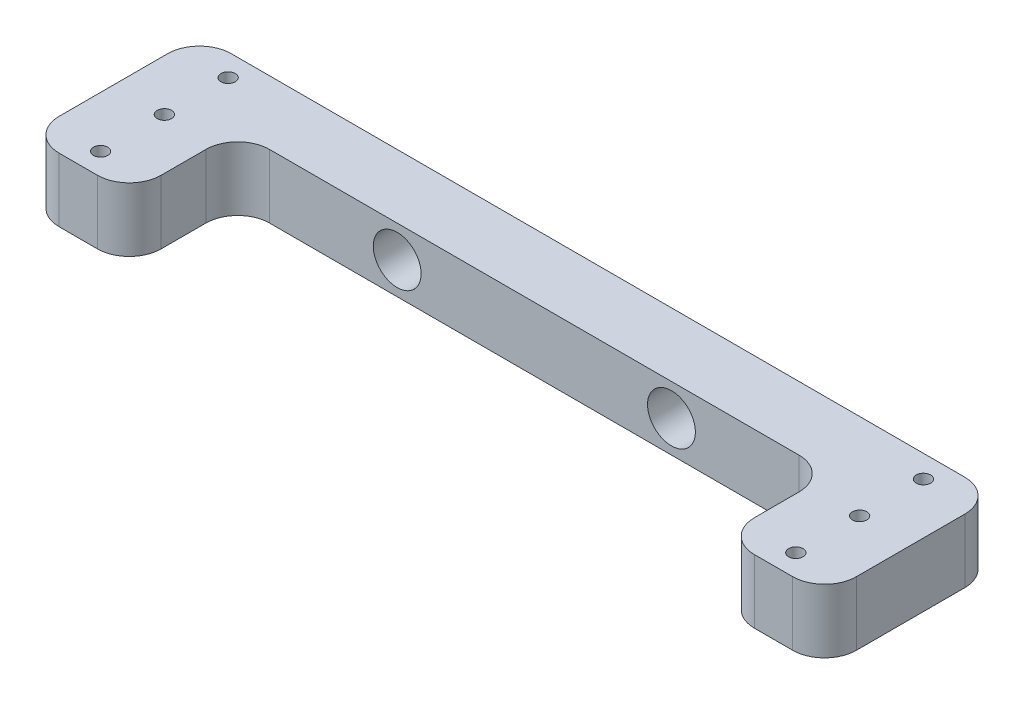
ISO-10303-21;
HEADER;
FILE_DESCRIPTION(('STEP AP214'),'2;1');
FILE_NAME('part.step','',(''),(''),'','','');
FILE_SCHEMA(('AUTOMOTIVE_DESIGN { 1 0 10303 214 1 1 1 1 }'));
ENDSEC;
DATA;
#1=APPLICATION_CONTEXT('core data for automotive mechanical design processes');
#2=APPLICATION_PROTOCOL_DEFINITION('international standard','automotive_design',2000,#1);
#3=PRODUCT_CONTEXT('',#1,'mechanical');
#4=PRODUCT('Part','Part','',(#3));
#5=PRODUCT_RELATED_PRODUCT_CATEGORY('part','',(#4));
#6=PRODUCT_DEFINITION_FORMATION('','',#4);
#7=PRODUCT_DEFINITION_CONTEXT('part definition',#1,'design');
#8=PRODUCT_DEFINITION('design','',#6,#7);
#9=PRODUCT_DEFINITION_SHAPE('','',#8);
#10=(LENGTH_UNIT() NAMED_UNIT(*) SI_UNIT(.MILLI.,.METRE.));
#11=(NAMED_UNIT(*) PLANE_ANGLE_UNIT() SI_UNIT($,.RADIAN.));
#12=(NAMED_UNIT(*) SI_UNIT($,.STERADIAN.) SOLID_ANGLE_UNIT());
#13=UNCERTAINTY_MEASURE_WITH_UNIT(LENGTH_MEASURE(1.E-05),#10,'distance_accuracy_value','');
#14=(GEOMETRIC_REPRESENTATION_CONTEXT(3) GLOBAL_UNCERTAINTY_ASSIGNED_CONTEXT((#13)) GLOBAL_UNIT_ASSIGNED_CONTEXT((#10,
#11,#12)) REPRESENTATION_CONTEXT('',''));
#15=CARTESIAN_POINT('',(0.,0.,0.));
#16=DIRECTION('',(0.,0.,1.));
#17=DIRECTION('',(1.,0.,0.));
#18=AXIS2_PLACEMENT_3D('',#15,#16,#17);
#19=CARTESIAN_POINT('',(-103.,20.,24.));
#20=DIRECTION('',(0.,1.,0.));
#21=DIRECTION('',(0.,0.,1.));
#22=AXIS2_PLACEMENT_3D('',#19,#20,#21);
#23=PLANE('',#22);
#24=CARTESIAN_POINT('',(109.,20.,6.99999999999993));
#25=DIRECTION('',(0.,1.,0.));
#26=DIRECTION('',(0.,0.,-1.));
#27=AXIS2_PLACEMENT_3D('',#24,#25,#26);
#28=CIRCLE('',#27,2.25);
#29=CARTESIAN_POINT('',(109.,20.,4.74999999999993));
#30=VERTEX_POINT('',#29);
#31=EDGE_CURVE('E413',#30,#30,#28,.T.);
#32=ORIENTED_EDGE('',*,*,#31,.F.);
#33=EDGE_LOOP('',(#32));
#34=FACE_BOUND('',#33,.T.);
#35=CARTESIAN_POINT('',(-109.,20.,27.));
#36=DIRECTION('',(0.,1.,0.));
#37=DIRECTION('',(0.,0.,1.));
#38=AXIS2_PLACEMENT_3D('',#35,#36,#37);
#39=CIRCLE('',#38,2.25);
#40=CARTESIAN_POINT('',(-109.,20.,29.25));
#41=VERTEX_POINT('',#40);
#42=EDGE_CURVE('E425',#41,#41,#39,.T.);
#43=ORIENTED_EDGE('',*,*,#42,.F.);
#44=EDGE_LOOP('',(#43));
#45=FACE_BOUND('',#44,.T.);
#46=CARTESIAN_POINT('',(-109.,20.,-13.));
#47=DIRECTION('',(0.,1.,0.));
#48=DIRECTION('',(0.,0.,1.));
#49=AXIS2_PLACEMENT_3D('',#46,#47,#48);
#50=CIRCLE('',#49,2.25);
#51=CARTESIAN_POINT('',(-109.,20.,-10.75));
#52=VERTEX_POINT('',#51);
#53=EDGE_CURVE('E196',#52,#52,#50,.T.);
#54=ORIENTED_EDGE('',*,*,#53,.F.);
#55=EDGE_LOOP('',(#54));
#56=FACE_BOUND('',#55,.T.);
#57=CARTESIAN_POINT('',(-103.,20.,24.));
#58=DIRECTION('',(0.,1.,0.));
#59=DIRECTION('',(0.,0.,1.));
#60=AXIS2_PLACEMENT_3D('',#57,#58,#59);
#61=CIRCLE('',#60,10.);
#62=CARTESIAN_POINT('',(-103.,20.,34.));
#63=VERTEX_POINT('',#62);
#64=CARTESIAN_POINT('',(-93.,20.,24.));
#65=VERTEX_POINT('',#64);
#66=EDGE_CURVE('E224',#63,#65,#61,.T.);
#67=ORIENTED_EDGE('',*,*,#66,.T.);
#68=DIRECTION('',(0.,0.,-1.));
#69=VECTOR('',#68,1.);
#70=CARTESIAN_POINT('',(-93.,20.,24.));
#71=LINE('',#70,#69);
#72=CARTESIAN_POINT('',(-93.,20.,10.));
#73=VERTEX_POINT('',#72);
#74=EDGE_CURVE('E131',#65,#73,#71,.T.);
#75=ORIENTED_EDGE('',*,*,#74,.T.);
#76=CARTESIAN_POINT('',(-83.,20.,10.));
#77=DIRECTION('',(0.,-1.,0.));
#78=DIRECTION('',(0.,0.,-1.));
#79=AXIS2_PLACEMENT_3D('',#76,#77,#78);
#80=CIRCLE('',#79,10.);
#81=CARTESIAN_POINT('',(-83.,20.,0.));
#82=VERTEX_POINT('',#81);
#83=EDGE_CURVE('E263',#73,#82,#80,.T.);
#84=ORIENTED_EDGE('',*,*,#83,.T.);
#85=DIRECTION('',(1.,0.,0.));
#86=VECTOR('',#85,1.);
#87=CARTESIAN_POINT('',(-83.,20.,0.));
#88=LINE('',#87,#86);
#89=CARTESIAN_POINT('',(83.,20.,0.));
#90=VERTEX_POINT('',#89);
#91=EDGE_CURVE('E281',#82,#90,#88,.T.);
#92=ORIENTED_EDGE('',*,*,#91,.T.);
#93=CARTESIAN_POINT('',(83.,20.,9.99999999999998));
#94=DIRECTION('',(0.,-1.,0.));
#95=DIRECTION('',(0.,0.,1.));
#96=AXIS2_PLACEMENT_3D('',#93,#94,#95);
#97=CIRCLE('',#96,10.);
#98=CARTESIAN_POINT('',(93.,20.,9.99999999999998));
#99=VERTEX_POINT('',#98);
#100=EDGE_CURVE('E278',#90,#99,#97,.T.);
#101=ORIENTED_EDGE('',*,*,#100,.T.);
#102=DIRECTION('',(0.,0.,1.));
#103=VECTOR('',#102,1.);
#104=CARTESIAN_POINT('',(93.,20.,23.9999999999999));
#105=LINE('',#104,#103);
#106=CARTESIAN_POINT('',(93.,20.,23.9999999999999));
#107=VERTEX_POINT('',#106);
#108=EDGE_CURVE('E280',#99,#107,#105,.T.);
#109=ORIENTED_EDGE('',*,*,#108,.T.);
#110=CARTESIAN_POINT('',(103.,20.,24.));
#111=DIRECTION('',(0.,1.,0.));
#112=DIRECTION('',(0.,0.,-1.));
#113=AXIS2_PLACEMENT_3D('',#110,#111,#112);
#114=CIRCLE('',#113,10.);
#115=CARTESIAN_POINT('',(103.,20.,34.));
#116=VERTEX_POINT('',#115);
#117=EDGE_CURVE('E283',#107,#116,#114,.T.);
#118=ORIENTED_EDGE('',*,*,#117,.T.);
#119=DIRECTION('',(1.,0.,0.));
#120=VECTOR('',#119,1.);
#121=CARTESIAN_POINT('',(115.,20.,34.));
#122=LINE('',#121,#120);
#123=CARTESIAN_POINT('',(115.,20.,34.));
#124=VERTEX_POINT('',#123);
#125=EDGE_CURVE('E289',#116,#124,#122,.T.);
#126=ORIENTED_EDGE('',*,*,#125,.T.);
#127=CARTESIAN_POINT('',(115.,20.,24.));
#128=DIRECTION('',(0.,1.,0.));
#129=DIRECTION('',(0.,0.,-1.));
#130=AXIS2_PLACEMENT_3D('',#127,#128,#129);
#131=CIRCLE('',#130,10.);
#132=CARTESIAN_POINT('',(125.,20.,23.9999999999999));
#133=VERTEX_POINT('',#132);
#134=EDGE_CURVE('E291',#124,#133,#131,.T.);
#135=ORIENTED_EDGE('',*,*,#134,.T.);
#136=DIRECTION('',(0.,0.,-1.));
#137=VECTOR('',#136,1.);
#138=CARTESIAN_POINT('',(125.,20.,-9.99999999999994));
#139=LINE('',#138,#137);
#140=CARTESIAN_POINT('',(125.,20.,-9.99999999999994));
#141=VERTEX_POINT('',#140);
#142=EDGE_CURVE('E293',#133,#141,#139,.T.);
#143=ORIENTED_EDGE('',*,*,#142,.T.);
#144=CARTESIAN_POINT('',(115.,20.,-10.));
#145=DIRECTION('',(0.,1.,0.));
#146=DIRECTION('',(0.,0.,-1.));
#147=AXIS2_PLACEMENT_3D('',#144,#145,#146);
#148=CIRCLE('',#147,10.);
#149=CARTESIAN_POINT('',(115.,20.,-20.));
#150=VERTEX_POINT('',#149);
#151=EDGE_CURVE('E295',#141,#150,#148,.T.);
#152=ORIENTED_EDGE('',*,*,#151,.T.);
#153=DIRECTION('',(-1.,0.,0.));
#154=VECTOR('',#153,1.);
#155=CARTESIAN_POINT('',(115.,20.,-20.));
#156=LINE('',#155,#154);
#157=CARTESIAN_POINT('',(-115.,20.,-20.));
#158=VERTEX_POINT('',#157);
#159=EDGE_CURVE('E297',#150,#158,#156,.T.);
#160=ORIENTED_EDGE('',*,*,#159,.T.);
#161=CARTESIAN_POINT('',(-115.,20.,-9.99999999999999));
#162=DIRECTION('',(0.,1.,0.));
#163=DIRECTION('',(0.,0.,1.));
#164=AXIS2_PLACEMENT_3D('',#161,#162,#163);
#165=CIRCLE('',#164,10.);
#166=CARTESIAN_POINT('',(-125.,20.,-9.99999999999991));
#167=VERTEX_POINT('',#166);
#168=EDGE_CURVE('E174',#158,#167,#165,.T.);
#169=ORIENTED_EDGE('',*,*,#168,.T.);
#170=DIRECTION('',(0.,0.,1.));
#171=VECTOR('',#170,1.);
#172=CARTESIAN_POINT('',(-125.,20.,-9.99999999999991));
#173=LINE('',#172,#171);
#174=CARTESIAN_POINT('',(-125.,20.,23.9999999999999));
#175=VERTEX_POINT('',#174);
#176=EDGE_CURVE('E168',#167,#175,#173,.T.);
#177=ORIENTED_EDGE('',*,*,#176,.T.);
#178=CARTESIAN_POINT('',(-115.,20.,24.));
#179=DIRECTION('',(0.,1.,0.));
#180=DIRECTION('',(0.,0.,1.));
#181=AXIS2_PLACEMENT_3D('',#178,#179,#180);
#182=CIRCLE('',#181,10.);
#183=CARTESIAN_POINT('',(-115.,20.,34.));
#184=VERTEX_POINT('',#183);
#185=EDGE_CURVE('E172',#175,#184,#182,.T.);
#186=ORIENTED_EDGE('',*,*,#185,.T.);
#187=DIRECTION('',(1.,0.,0.));
#188=VECTOR('',#187,1.);
#189=CARTESIAN_POINT('',(-115.,20.,34.));
#190=LINE('',#189,#188);
#191=EDGE_CURVE('E64',#184,#63,#190,.T.);
#192=ORIENTED_EDGE('',*,*,#191,.T.);
#193=EDGE_LOOP('',(#67,#75,#84,#92,#101,#109,#118,#126,#135,#143,#152,#160,#169,#177,#186,#192));
#194=FACE_BOUND('',#193,.T.);
#195=CARTESIAN_POINT('',(-109.,20.,6.99999999999998));
#196=DIRECTION('',(0.,1.,0.));
#197=DIRECTION('',(0.,0.,1.));
#198=AXIS2_PLACEMENT_3D('',#195,#196,#197);
#199=CIRCLE('',#198,2.25);
#200=CARTESIAN_POINT('',(-109.,20.,9.24999999999998));
#201=VERTEX_POINT('',#200);
#202=EDGE_CURVE('E431',#201,#201,#199,.T.);
#203=ORIENTED_EDGE('',*,*,#202,.F.);
#204=EDGE_LOOP('',(#203));
#205=FACE_BOUND('',#204,.T.);
#206=CARTESIAN_POINT('',(109.,20.,26.9999999999999));
#207=DIRECTION('',(0.,1.,0.));
#208=DIRECTION('',(0.,0.,-1.));
#209=AXIS2_PLACEMENT_3D('',#206,#207,#208);
#210=CIRCLE('',#209,2.25);
#211=CARTESIAN_POINT('',(109.,20.,24.7499999999999));
#212=VERTEX_POINT('',#211);
#213=EDGE_CURVE('E419',#212,#212,#210,.T.);
#214=ORIENTED_EDGE('',*,*,#213,.F.);
#215=EDGE_LOOP('',(#214));
#216=FACE_BOUND('',#215,.T.);
#217=CARTESIAN_POINT('',(109.,20.,-13.));
#218=DIRECTION('',(0.,1.,0.));
#219=DIRECTION('',(0.,0.,-1.));
#220=AXIS2_PLACEMENT_3D('',#217,#218,#219);
#221=CIRCLE('',#220,2.25);
#222=CARTESIAN_POINT('',(109.,20.,-15.25));
#223=VERTEX_POINT('',#222);
#224=EDGE_CURVE('E407',#223,#223,#221,.T.);
#225=ORIENTED_EDGE('',*,*,#224,.F.);
#226=EDGE_LOOP('',(#225));
#227=FACE_BOUND('',#226,.T.);
#228=ADVANCED_FACE('F47',(#34,#45,#56,#194,#205,#216,#227),#23,.T.);
#229=CARTESIAN_POINT('',(-103.,0.,24.));
#230=DIRECTION('',(0.,1.,0.));
#231=DIRECTION('',(0.,0.,1.));
#232=AXIS2_PLACEMENT_3D('',#229,#230,#231);
#233=PLANE('',#232);
#234=CARTESIAN_POINT('',(-103.,0.,24.));
#235=DIRECTION('',(0.,1.,0.));
#236=DIRECTION('',(0.,0.,1.));
#237=AXIS2_PLACEMENT_3D('',#234,#235,#236);
#238=CIRCLE('',#237,10.);
#239=CARTESIAN_POINT('',(-103.,0.,34.));
#240=VERTEX_POINT('',#239);
#241=CARTESIAN_POINT('',(-93.,0.,24.));
#242=VERTEX_POINT('',#241);
#243=EDGE_CURVE('E192',#240,#242,#238,.T.);
#244=ORIENTED_EDGE('',*,*,#243,.F.);
#245=DIRECTION('',(1.,0.,0.));
#246=VECTOR('',#245,1.);
#247=CARTESIAN_POINT('',(-115.,0.,34.));
#248=LINE('',#247,#246);
#249=CARTESIAN_POINT('',(-115.,0.,34.));
#250=VERTEX_POINT('',#249);
#251=EDGE_CURVE('E123',#250,#240,#248,.T.);
#252=ORIENTED_EDGE('',*,*,#251,.F.);
#253=CARTESIAN_POINT('',(-115.,0.,24.));
#254=DIRECTION('',(0.,1.,0.));
#255=DIRECTION('',(0.,0.,1.));
#256=AXIS2_PLACEMENT_3D('',#253,#254,#255);
#257=CIRCLE('',#256,10.);
#258=CARTESIAN_POINT('',(-125.,0.,23.9999999999999));
#259=VERTEX_POINT('',#258);
#260=EDGE_CURVE('E117',#259,#250,#257,.T.);
#261=ORIENTED_EDGE('',*,*,#260,.F.);
#262=DIRECTION('',(0.,0.,1.));
#263=VECTOR('',#262,1.);
#264=CARTESIAN_POINT('',(-125.,0.,-9.99999999999991));
#265=LINE('',#264,#263);
#266=CARTESIAN_POINT('',(-125.,0.,-9.99999999999991));
#267=VERTEX_POINT('',#266);
#268=EDGE_CURVE('E182',#267,#259,#265,.T.);
#269=ORIENTED_EDGE('',*,*,#268,.F.);
#270=CARTESIAN_POINT('',(-115.,0.,-9.99999999999999));
#271=DIRECTION('',(0.,1.,0.));
#272=DIRECTION('',(0.,0.,1.));
#273=AXIS2_PLACEMENT_3D('',#270,#271,#272);
#274=CIRCLE('',#273,10.);
#275=CARTESIAN_POINT('',(-115.,0.,-20.));
#276=VERTEX_POINT('',#275);
#277=EDGE_CURVE('E219',#276,#267,#274,.T.);
#278=ORIENTED_EDGE('',*,*,#277,.F.);
#279=DIRECTION('',(-1.,0.,0.));
#280=VECTOR('',#279,1.);
#281=CARTESIAN_POINT('',(115.,0.,-20.));
#282=LINE('',#281,#280);
#283=CARTESIAN_POINT('',(115.,0.,-20.));
#284=VERTEX_POINT('',#283);
#285=EDGE_CURVE('E217',#284,#276,#282,.T.);
#286=ORIENTED_EDGE('',*,*,#285,.F.);
#287=CARTESIAN_POINT('',(115.,0.,-10.));
#288=DIRECTION('',(0.,1.,0.));
#289=DIRECTION('',(0.,0.,-1.));
#290=AXIS2_PLACEMENT_3D('',#287,#288,#289);
#291=CIRCLE('',#290,10.);
#292=CARTESIAN_POINT('',(125.,0.,-9.99999999999994));
#293=VERTEX_POINT('',#292);
#294=EDGE_CURVE('E215',#293,#284,#291,.T.);
#295=ORIENTED_EDGE('',*,*,#294,.F.);
#296=DIRECTION('',(0.,0.,-1.));
#297=VECTOR('',#296,1.);
#298=CARTESIAN_POINT('',(125.,0.,-9.99999999999994));
#299=LINE('',#298,#297);
#300=CARTESIAN_POINT('',(125.,0.,23.9999999999999));
#301=VERTEX_POINT('',#300);
#302=EDGE_CURVE('E213',#301,#293,#299,.T.);
#303=ORIENTED_EDGE('',*,*,#302,.F.);
#304=CARTESIAN_POINT('',(115.,0.,24.));
#305=DIRECTION('',(0.,1.,0.));
#306=DIRECTION('',(0.,0.,-1.));
#307=AXIS2_PLACEMENT_3D('',#304,#305,#306);
#308=CIRCLE('',#307,10.);
#309=CARTESIAN_POINT('',(115.,0.,34.));
#310=VERTEX_POINT('',#309);
#311=EDGE_CURVE('E211',#310,#301,#308,.T.);
#312=ORIENTED_EDGE('',*,*,#311,.F.);
#313=DIRECTION('',(1.,0.,0.));
#314=VECTOR('',#313,1.);
#315=CARTESIAN_POINT('',(115.,0.,34.));
#316=LINE('',#315,#314);
#317=CARTESIAN_POINT('',(103.,0.,34.));
#318=VERTEX_POINT('',#317);
#319=EDGE_CURVE('E209',#318,#310,#316,.T.);
#320=ORIENTED_EDGE('',*,*,#319,.F.);
#321=CARTESIAN_POINT('',(103.,0.,24.));
#322=DIRECTION('',(0.,1.,0.));
#323=DIRECTION('',(0.,0.,-1.));
#324=AXIS2_PLACEMENT_3D('',#321,#322,#323);
#325=CIRCLE('',#324,10.);
#326=CARTESIAN_POINT('',(93.,0.,23.9999999999999));
#327=VERTEX_POINT('',#326);
#328=EDGE_CURVE('E207',#327,#318,#325,.T.);
#329=ORIENTED_EDGE('',*,*,#328,.F.);
#330=DIRECTION('',(0.,0.,1.));
#331=VECTOR('',#330,1.);
#332=CARTESIAN_POINT('',(93.,0.,23.9999999999999));
#333=LINE('',#332,#331);
#334=CARTESIAN_POINT('',(93.,0.,9.99999999999998));
#335=VERTEX_POINT('',#334);
#336=EDGE_CURVE('E205',#335,#327,#333,.T.);
#337=ORIENTED_EDGE('',*,*,#336,.F.);
#338=CARTESIAN_POINT('',(83.,0.,9.99999999999998));
#339=DIRECTION('',(0.,-1.,0.));
#340=DIRECTION('',(0.,0.,1.));
#341=AXIS2_PLACEMENT_3D('',#338,#339,#340);
#342=CIRCLE('',#341,10.);
#343=CARTESIAN_POINT('',(83.,0.,0.));
#344=VERTEX_POINT('',#343);
#345=EDGE_CURVE('E203',#344,#335,#342,.T.);
#346=ORIENTED_EDGE('',*,*,#345,.F.);
#347=DIRECTION('',(1.,0.,0.));
#348=VECTOR('',#347,1.);
#349=CARTESIAN_POINT('',(83.,0.,0.));
#350=LINE('',#349,#348);
#351=CARTESIAN_POINT('',(-83.,0.,0.));
#352=VERTEX_POINT('',#351);
#353=EDGE_CURVE('E201',#352,#344,#350,.T.);
#354=ORIENTED_EDGE('',*,*,#353,.F.);
#355=CARTESIAN_POINT('',(-83.,0.,10.));
#356=DIRECTION('',(0.,-1.,0.));
#357=DIRECTION('',(0.,0.,-1.));
#358=AXIS2_PLACEMENT_3D('',#355,#356,#357);
#359=CIRCLE('',#358,10.);
#360=CARTESIAN_POINT('',(-93.,0.,10.));
#361=VERTEX_POINT('',#360);
#362=EDGE_CURVE('E198',#361,#352,#359,.T.);
#363=ORIENTED_EDGE('',*,*,#362,.F.);
#364=DIRECTION('',(0.,0.,-1.));
#365=VECTOR('',#364,1.);
#366=CARTESIAN_POINT('',(-93.,0.,24.));
#367=LINE('',#366,#365);
#368=EDGE_CURVE('E195',#242,#361,#367,.T.);
#369=ORIENTED_EDGE('',*,*,#368,.F.);
#370=EDGE_LOOP('',(#244,#252,#261,#269,#278,#286,#295,#303,#312,#320,#329,#337,#346,#354,#363,#369));
#371=FACE_BOUND('',#370,.T.);
#372=CARTESIAN_POINT('',(-109.,0.,-13.));
#373=DIRECTION('',(0.,1.,0.));
#374=DIRECTION('',(0.,0.,1.));
#375=AXIS2_PLACEMENT_3D('',#372,#373,#374);
#376=CIRCLE('',#375,2.25);
#377=CARTESIAN_POINT('',(-109.,0.,-10.75));
#378=VERTEX_POINT('',#377);
#379=EDGE_CURVE('E434',#378,#378,#376,.T.);
#380=ORIENTED_EDGE('',*,*,#379,.T.);
#381=EDGE_LOOP('',(#380));
#382=FACE_BOUND('',#381,.T.);
#383=CARTESIAN_POINT('',(-109.,0.,6.99999999999998));
#384=DIRECTION('',(0.,1.,0.));
#385=DIRECTION('',(0.,0.,1.));
#386=AXIS2_PLACEMENT_3D('',#383,#384,#385);
#387=CIRCLE('',#386,2.25);
#388=CARTESIAN_POINT('',(-109.,0.,9.24999999999998));
#389=VERTEX_POINT('',#388);
#390=EDGE_CURVE('E428',#389,#389,#387,.T.);
#391=ORIENTED_EDGE('',*,*,#390,.T.);
#392=EDGE_LOOP('',(#391));
#393=FACE_BOUND('',#392,.T.);
#394=CARTESIAN_POINT('',(-109.,0.,27.));
#395=DIRECTION('',(0.,1.,0.));
#396=DIRECTION('',(0.,0.,1.));
#397=AXIS2_PLACEMENT_3D('',#394,#395,#396);
#398=CIRCLE('',#397,2.25);
#399=CARTESIAN_POINT('',(-109.,0.,29.25));
#400=VERTEX_POINT('',#399);
#401=EDGE_CURVE('E422',#400,#400,#398,.T.);
#402=ORIENTED_EDGE('',*,*,#401,.T.);
#403=EDGE_LOOP('',(#402));
#404=FACE_BOUND('',#403,.T.);
#405=CARTESIAN_POINT('',(109.,0.,26.9999999999999));
#406=DIRECTION('',(0.,1.,0.));
#407=DIRECTION('',(0.,0.,-1.));
#408=AXIS2_PLACEMENT_3D('',#405,#406,#407);
#409=CIRCLE('',#408,2.25);
#410=CARTESIAN_POINT('',(109.,0.,24.7499999999999));
#411=VERTEX_POINT('',#410);
#412=EDGE_CURVE('E416',#411,#411,#409,.T.);
#413=ORIENTED_EDGE('',*,*,#412,.T.);
#414=EDGE_LOOP('',(#413));
#415=FACE_BOUND('',#414,.T.);
#416=CARTESIAN_POINT('',(109.,0.,6.99999999999993));
#417=DIRECTION('',(0.,1.,0.));
#418=DIRECTION('',(0.,0.,-1.));
#419=AXIS2_PLACEMENT_3D('',#416,#417,#418);
#420=CIRCLE('',#419,2.25);
#421=CARTESIAN_POINT('',(109.,0.,4.74999999999993));
#422=VERTEX_POINT('',#421);
#423=EDGE_CURVE('E410',#422,#422,#420,.T.);
#424=ORIENTED_EDGE('',*,*,#423,.T.);
#425=EDGE_LOOP('',(#424));
#426=FACE_BOUND('',#425,.T.);
#427=CARTESIAN_POINT('',(109.,0.,-13.));
#428=DIRECTION('',(0.,1.,0.));
#429=DIRECTION('',(0.,0.,-1.));
#430=AXIS2_PLACEMENT_3D('',#427,#428,#429);
#431=CIRCLE('',#430,2.25);
#432=CARTESIAN_POINT('',(109.,0.,-15.25));
#433=VERTEX_POINT('',#432);
#434=EDGE_CURVE('E401',#433,#433,#431,.T.);
#435=ORIENTED_EDGE('',*,*,#434,.T.);
#436=EDGE_LOOP('',(#435));
#437=FACE_BOUND('',#436,.T.);
#438=ADVANCED_FACE('F266',(#371,#382,#393,#404,#415,#426,#437),#233,.F.);
#439=CARTESIAN_POINT('',(-103.,20.,24.));
#440=DIRECTION('',(0.,-1.,0.));
#441=DIRECTION('',(0.,0.,-1.));
#442=AXIS2_PLACEMENT_3D('',#439,#440,#441);
#443=CYLINDRICAL_SURFACE('',#442,10.);
#444=ORIENTED_EDGE('',*,*,#243,.T.);
#445=DIRECTION('',(0.,-1.,0.));
#446=VECTOR('',#445,1.);
#447=CARTESIAN_POINT('',(-93.,20.,24.));
#448=LINE('',#447,#446);
#449=EDGE_CURVE('E13',#65,#242,#448,.T.);
#450=ORIENTED_EDGE('',*,*,#449,.F.);
#451=ORIENTED_EDGE('',*,*,#66,.F.);
#452=DIRECTION('',(0.,-1.,0.));
#453=VECTOR('',#452,1.);
#454=CARTESIAN_POINT('',(-103.,20.,34.));
#455=LINE('',#454,#453);
#456=EDGE_CURVE('E188',#63,#240,#455,.T.);
#457=ORIENTED_EDGE('',*,*,#456,.T.);
#458=EDGE_LOOP('',(#444,#450,#451,#457));
#459=FACE_BOUND('',#458,.T.);
#460=ADVANCED_FACE('F49',(#459),#443,.T.);
#461=CARTESIAN_POINT('',(-93.,20.,24.));
#462=DIRECTION('',(-1.,0.,0.));
#463=DIRECTION('',(0.,0.,1.));
#464=AXIS2_PLACEMENT_3D('',#461,#462,#463);
#465=PLANE('',#464);
#466=ORIENTED_EDGE('',*,*,#368,.T.);
#467=DIRECTION('',(0.,-1.,0.));
#468=VECTOR('',#467,1.);
#469=CARTESIAN_POINT('',(-93.,20.,10.));
#470=LINE('',#469,#468);
#471=EDGE_CURVE('E56',#73,#361,#470,.T.);
#472=ORIENTED_EDGE('',*,*,#471,.F.);
#473=ORIENTED_EDGE('',*,*,#74,.F.);
#474=ORIENTED_EDGE('',*,*,#449,.T.);
#475=EDGE_LOOP('',(#466,#472,#473,#474));
#476=FACE_BOUND('',#475,.T.);
#477=ADVANCED_FACE('F481',(#476),#465,.F.);
#478=CARTESIAN_POINT('',(-83.,20.,10.));
#479=DIRECTION('',(0.,-1.,0.));
#480=DIRECTION('',(0.,0.,-1.));
#481=AXIS2_PLACEMENT_3D('',#478,#479,#480);
#482=CYLINDRICAL_SURFACE('',#481,10.);
#483=ORIENTED_EDGE('',*,*,#362,.T.);
#484=DIRECTION('',(0.,-1.,0.));
#485=VECTOR('',#484,1.);
#486=CARTESIAN_POINT('',(-83.,20.,0.));
#487=LINE('',#486,#485);
#488=EDGE_CURVE('E255',#82,#352,#487,.T.);
#489=ORIENTED_EDGE('',*,*,#488,.F.);
#490=ORIENTED_EDGE('',*,*,#83,.F.);
#491=ORIENTED_EDGE('',*,*,#471,.T.);
#492=EDGE_LOOP('',(#483,#489,#490,#491));
#493=FACE_BOUND('',#492,.T.);
#494=ADVANCED_FACE('F261',(#493),#482,.F.);
#495=CARTESIAN_POINT('',(83.,20.,0.));
#496=DIRECTION('',(0.,0.,-1.));
#497=DIRECTION('',(-1.,0.,0.));
#498=AXIS2_PLACEMENT_3D('',#495,#496,#497);
#499=PLANE('',#498);
#500=CARTESIAN_POINT('',(-43.,10.,0.));
#501=DIRECTION('',(0.,0.,1.));
#502=DIRECTION('',(1.,0.,0.));
#503=AXIS2_PLACEMENT_3D('',#500,#501,#502);
#504=CIRCLE('',#503,7.5);
#505=CARTESIAN_POINT('',(-35.5,10.,0.));
#506=VERTEX_POINT('',#505);
#507=EDGE_CURVE('E402',#506,#506,#504,.T.);
#508=ORIENTED_EDGE('',*,*,#507,.F.);
#509=EDGE_LOOP('',(#508));
#510=FACE_BOUND('',#509,.T.);
#511=CARTESIAN_POINT('',(43.,10.,0.));
#512=DIRECTION('',(0.,0.,1.));
#513=DIRECTION('',(-1.,0.,0.));
#514=AXIS2_PLACEMENT_3D('',#511,#512,#513);
#515=CIRCLE('',#514,7.5);
#516=CARTESIAN_POINT('',(35.5,10.,0.));
#517=VERTEX_POINT('',#516);
#518=EDGE_CURVE('E385',#517,#517,#515,.T.);
#519=ORIENTED_EDGE('',*,*,#518,.F.);
#520=EDGE_LOOP('',(#519));
#521=FACE_BOUND('',#520,.T.);
#522=ORIENTED_EDGE('',*,*,#353,.T.);
#523=DIRECTION('',(0.,-1.,0.));
#524=VECTOR('',#523,1.);
#525=CARTESIAN_POINT('',(83.,20.,0.));
#526=LINE('',#525,#524);
#527=EDGE_CURVE('E252',#90,#344,#526,.T.);
#528=ORIENTED_EDGE('',*,*,#527,.F.);
#529=ORIENTED_EDGE('',*,*,#91,.F.);
#530=ORIENTED_EDGE('',*,*,#488,.T.);
#531=EDGE_LOOP('',(#522,#528,#529,#530));
#532=FACE_BOUND('',#531,.T.);
#533=ADVANCED_FACE('F272',(#510,#521,#532),#499,.F.);
#534=CARTESIAN_POINT('',(83.,20.,9.99999999999998));
#535=DIRECTION('',(0.,-1.,0.));
#536=DIRECTION('',(0.,0.,-1.));
#537=AXIS2_PLACEMENT_3D('',#534,#535,#536);
#538=CYLINDRICAL_SURFACE('',#537,10.);
#539=ORIENTED_EDGE('',*,*,#345,.T.);
#540=DIRECTION('',(0.,-1.,0.));
#541=VECTOR('',#540,1.);
#542=CARTESIAN_POINT('',(93.,20.,9.99999999999998));
#543=LINE('',#542,#541);
#544=EDGE_CURVE('E249',#99,#335,#543,.T.);
#545=ORIENTED_EDGE('',*,*,#544,.F.);
#546=ORIENTED_EDGE('',*,*,#100,.F.);
#547=ORIENTED_EDGE('',*,*,#527,.T.);
#548=EDGE_LOOP('',(#539,#545,#546,#547));
#549=FACE_BOUND('',#548,.T.);
#550=ADVANCED_FACE('F276',(#549),#538,.F.);
#551=CARTESIAN_POINT('',(93.,20.,23.9999999999999));
#552=DIRECTION('',(1.,0.,0.));
#553=DIRECTION('',(0.,0.,-1.));
#554=AXIS2_PLACEMENT_3D('',#551,#552,#553);
#555=PLANE('',#554);
#556=ORIENTED_EDGE('',*,*,#336,.T.);
#557=DIRECTION('',(0.,-1.,0.));
#558=VECTOR('',#557,1.);
#559=CARTESIAN_POINT('',(93.,20.,23.9999999999999));
#560=LINE('',#559,#558);
#561=EDGE_CURVE('E246',#107,#327,#560,.T.);
#562=ORIENTED_EDGE('',*,*,#561,.F.);
#563=ORIENTED_EDGE('',*,*,#108,.F.);
#564=ORIENTED_EDGE('',*,*,#544,.T.);
#565=EDGE_LOOP('',(#556,#562,#563,#564));
#566=FACE_BOUND('',#565,.T.);
#567=ADVANCED_FACE('F479',(#566),#555,.F.);
#568=CARTESIAN_POINT('',(103.,20.,24.));
#569=DIRECTION('',(0.,-1.,0.));
#570=DIRECTION('',(0.,0.,-1.));
#571=AXIS2_PLACEMENT_3D('',#568,#569,#570);
#572=CYLINDRICAL_SURFACE('',#571,10.);
#573=ORIENTED_EDGE('',*,*,#328,.T.);
#574=DIRECTION('',(0.,-1.,0.));
#575=VECTOR('',#574,1.);
#576=CARTESIAN_POINT('',(103.,20.,34.));
#577=LINE('',#576,#575);
#578=EDGE_CURVE('E243',#116,#318,#577,.T.);
#579=ORIENTED_EDGE('',*,*,#578,.F.);
#580=ORIENTED_EDGE('',*,*,#117,.F.);
#581=ORIENTED_EDGE('',*,*,#561,.T.);
#582=EDGE_LOOP('',(#573,#579,#580,#581));
#583=FACE_BOUND('',#582,.T.);
#584=ADVANCED_FACE('F537',(#583),#572,.T.);
#585=CARTESIAN_POINT('',(115.,20.,34.));
#586=DIRECTION('',(0.,0.,-1.));
#587=DIRECTION('',(-1.,0.,0.));
#588=AXIS2_PLACEMENT_3D('',#585,#586,#587);
#589=PLANE('',#588);
#590=ORIENTED_EDGE('',*,*,#319,.T.);
#591=DIRECTION('',(0.,-1.,0.));
#592=VECTOR('',#591,1.);
#593=CARTESIAN_POINT('',(115.,20.,34.));
#594=LINE('',#593,#592);
#595=EDGE_CURVE('E240',#124,#310,#594,.T.);
#596=ORIENTED_EDGE('',*,*,#595,.F.);
#597=ORIENTED_EDGE('',*,*,#125,.F.);
#598=ORIENTED_EDGE('',*,*,#578,.T.);
#599=EDGE_LOOP('',(#590,#596,#597,#598));
#600=FACE_BOUND('',#599,.T.);
#601=ADVANCED_FACE('F545',(#600),#589,.F.);
#602=CARTESIAN_POINT('',(115.,20.,24.));
#603=DIRECTION('',(0.,-1.,0.));
#604=DIRECTION('',(0.,0.,-1.));
#605=AXIS2_PLACEMENT_3D('',#602,#603,#604);
#606=CYLINDRICAL_SURFACE('',#605,10.);
#607=ORIENTED_EDGE('',*,*,#311,.T.);
#608=DIRECTION('',(0.,-1.,0.));
#609=VECTOR('',#608,1.);
#610=CARTESIAN_POINT('',(125.,20.,23.9999999999999));
#611=LINE('',#610,#609);
#612=EDGE_CURVE('E237',#133,#301,#611,.T.);
#613=ORIENTED_EDGE('',*,*,#612,.F.);
#614=ORIENTED_EDGE('',*,*,#134,.F.);
#615=ORIENTED_EDGE('',*,*,#595,.T.);
#616=EDGE_LOOP('',(#607,#613,#614,#615));
#617=FACE_BOUND('',#616,.T.);
#618=ADVANCED_FACE('F554',(#617),#606,.T.);
#619=CARTESIAN_POINT('',(125.,20.,-9.99999999999994));
#620=DIRECTION('',(-1.,0.,0.));
#621=DIRECTION('',(0.,0.,1.));
#622=AXIS2_PLACEMENT_3D('',#619,#620,#621);
#623=PLANE('',#622);
#624=ORIENTED_EDGE('',*,*,#302,.T.);
#625=DIRECTION('',(0.,-1.,0.));
#626=VECTOR('',#625,1.);
#627=CARTESIAN_POINT('',(125.,20.,-9.99999999999994));
#628=LINE('',#627,#626);
#629=EDGE_CURVE('E234',#141,#293,#628,.T.);
#630=ORIENTED_EDGE('',*,*,#629,.F.);
#631=ORIENTED_EDGE('',*,*,#142,.F.);
#632=ORIENTED_EDGE('',*,*,#612,.T.);
#633=EDGE_LOOP('',(#624,#630,#631,#632));
#634=FACE_BOUND('',#633,.T.);
#635=ADVANCED_FACE('F563',(#634),#623,.F.);
#636=CARTESIAN_POINT('',(115.,20.,-10.));
#637=DIRECTION('',(0.,-1.,0.));
#638=DIRECTION('',(0.,0.,-1.));
#639=AXIS2_PLACEMENT_3D('',#636,#637,#638);
#640=CYLINDRICAL_SURFACE('',#639,10.);
#641=ORIENTED_EDGE('',*,*,#294,.T.);
#642=DIRECTION('',(0.,-1.,0.));
#643=VECTOR('',#642,1.);
#644=CARTESIAN_POINT('',(115.,20.,-20.));
#645=LINE('',#644,#643);
#646=EDGE_CURVE('E231',#150,#284,#645,.T.);
#647=ORIENTED_EDGE('',*,*,#646,.F.);
#648=ORIENTED_EDGE('',*,*,#151,.F.);
#649=ORIENTED_EDGE('',*,*,#629,.T.);
#650=EDGE_LOOP('',(#641,#647,#648,#649));
#651=FACE_BOUND('',#650,.T.);
#652=ADVANCED_FACE('F572',(#651),#640,.T.);
#653=CARTESIAN_POINT('',(115.,20.,-20.));
#654=DIRECTION('',(0.,0.,1.));
#655=DIRECTION('',(1.,0.,0.));
#656=AXIS2_PLACEMENT_3D('',#653,#654,#655);
#657=PLANE('',#656);
#658=CARTESIAN_POINT('',(-43.,10.,-20.));
#659=DIRECTION('',(0.,0.,1.));
#660=DIRECTION('',(1.,0.,0.));
#661=AXIS2_PLACEMENT_3D('',#658,#659,#660);
#662=CIRCLE('',#661,2.5);
#663=CARTESIAN_POINT('',(-40.5,10.,-20.));
#664=VERTEX_POINT('',#663);
#665=EDGE_CURVE('E383',#664,#664,#662,.F.);
#666=ORIENTED_EDGE('',*,*,#665,.F.);
#667=EDGE_LOOP('',(#666));
#668=FACE_BOUND('',#667,.T.);
#669=CARTESIAN_POINT('',(43.,10.,-20.));
#670=DIRECTION('',(0.,0.,1.));
#671=DIRECTION('',(1.,0.,0.));
#672=AXIS2_PLACEMENT_3D('',#669,#670,#671);
#673=CIRCLE('',#672,2.5);
#674=CARTESIAN_POINT('',(45.5,10.,-20.));
#675=VERTEX_POINT('',#674);
#676=EDGE_CURVE('E390',#675,#675,#673,.F.);
#677=ORIENTED_EDGE('',*,*,#676,.F.);
#678=EDGE_LOOP('',(#677));
#679=FACE_BOUND('',#678,.T.);
#680=ORIENTED_EDGE('',*,*,#285,.T.);
#681=DIRECTION('',(0.,-1.,0.));
#682=VECTOR('',#681,1.);
#683=CARTESIAN_POINT('',(-115.,20.,-20.));
#684=LINE('',#683,#682);
#685=EDGE_CURVE('E228',#158,#276,#684,.T.);
#686=ORIENTED_EDGE('',*,*,#685,.F.);
#687=ORIENTED_EDGE('',*,*,#159,.F.);
#688=ORIENTED_EDGE('',*,*,#646,.T.);
#689=EDGE_LOOP('',(#680,#686,#687,#688));
#690=FACE_BOUND('',#689,.T.);
#691=ADVANCED_FACE('F303',(#668,#679,#690),#657,.F.);
#692=CARTESIAN_POINT('',(-115.,20.,-9.99999999999999));
#693=DIRECTION('',(0.,-1.,0.));
#694=DIRECTION('',(0.,0.,-1.));
#695=AXIS2_PLACEMENT_3D('',#692,#693,#694);
#696=CYLINDRICAL_SURFACE('',#695,10.);
#697=ORIENTED_EDGE('',*,*,#277,.T.);
#698=DIRECTION('',(0.,-1.,0.));
#699=VECTOR('',#698,1.);
#700=CARTESIAN_POINT('',(-125.,20.,-9.99999999999991));
#701=LINE('',#700,#699);
#702=EDGE_CURVE('E183',#167,#267,#701,.T.);
#703=ORIENTED_EDGE('',*,*,#702,.F.);
#704=ORIENTED_EDGE('',*,*,#168,.F.);
#705=ORIENTED_EDGE('',*,*,#685,.T.);
#706=EDGE_LOOP('',(#697,#703,#704,#705));
#707=FACE_BOUND('',#706,.T.);
#708=ADVANCED_FACE('F307',(#707),#696,.T.);
#709=CARTESIAN_POINT('',(-125.,20.,-9.99999999999991));
#710=DIRECTION('',(1.,0.,0.));
#711=DIRECTION('',(0.,0.,-1.));
#712=AXIS2_PLACEMENT_3D('',#709,#710,#711);
#713=PLANE('',#712);
#714=ORIENTED_EDGE('',*,*,#268,.T.);
#715=DIRECTION('',(0.,-1.,0.));
#716=VECTOR('',#715,1.);
#717=CARTESIAN_POINT('',(-125.,20.,23.9999999999999));
#718=LINE('',#717,#716);
#719=EDGE_CURVE('E179',#175,#259,#718,.T.);
#720=ORIENTED_EDGE('',*,*,#719,.F.);
#721=ORIENTED_EDGE('',*,*,#176,.F.);
#722=ORIENTED_EDGE('',*,*,#702,.T.);
#723=EDGE_LOOP('',(#714,#720,#721,#722));
#724=FACE_BOUND('',#723,.T.);
#725=ADVANCED_FACE('F180',(#724),#713,.F.);
#726=CARTESIAN_POINT('',(-115.,20.,24.));
#727=DIRECTION('',(0.,-1.,0.));
#728=DIRECTION('',(0.,0.,-1.));
#729=AXIS2_PLACEMENT_3D('',#726,#727,#728);
#730=CYLINDRICAL_SURFACE('',#729,10.);
#731=ORIENTED_EDGE('',*,*,#260,.T.);
#732=DIRECTION('',(0.,-1.,0.));
#733=VECTOR('',#732,1.);
#734=CARTESIAN_POINT('',(-115.,20.,34.));
#735=LINE('',#734,#733);
#736=EDGE_CURVE('E184',#184,#250,#735,.T.);
#737=ORIENTED_EDGE('',*,*,#736,.F.);
#738=ORIENTED_EDGE('',*,*,#185,.F.);
#739=ORIENTED_EDGE('',*,*,#719,.T.);
#740=EDGE_LOOP('',(#731,#737,#738,#739));
#741=FACE_BOUND('',#740,.T.);
#742=ADVANCED_FACE('F186',(#741),#730,.T.);
#743=CARTESIAN_POINT('',(-115.,20.,34.));
#744=DIRECTION('',(0.,0.,-1.));
#745=DIRECTION('',(-1.,0.,0.));
#746=AXIS2_PLACEMENT_3D('',#743,#744,#745);
#747=PLANE('',#746);
#748=ORIENTED_EDGE('',*,*,#251,.T.);
#749=ORIENTED_EDGE('',*,*,#456,.F.);
#750=ORIENTED_EDGE('',*,*,#191,.F.);
#751=ORIENTED_EDGE('',*,*,#736,.T.);
#752=EDGE_LOOP('',(#748,#749,#750,#751));
#753=FACE_BOUND('',#752,.T.);
#754=ADVANCED_FACE('F311',(#753),#747,.F.);
#755=CARTESIAN_POINT('',(-109.,20.,-13.));
#756=DIRECTION('',(0.,-1.,0.));
#757=DIRECTION('',(0.,0.,-1.));
#758=AXIS2_PLACEMENT_3D('',#755,#756,#757);
#759=CYLINDRICAL_SURFACE('',#758,2.25);
#760=ORIENTED_EDGE('',*,*,#53,.T.);
#761=EDGE_LOOP('',(#760));
#762=FACE_BOUND('',#761,.T.);
#763=ORIENTED_EDGE('',*,*,#379,.F.);
#764=EDGE_LOOP('',(#763));
#765=FACE_BOUND('',#764,.T.);
#766=ADVANCED_FACE('F313',(#762,#765),#759,.F.);
#767=CARTESIAN_POINT('',(-109.,20.,6.99999999999998));
#768=DIRECTION('',(0.,-1.,0.));
#769=DIRECTION('',(0.,0.,-1.));
#770=AXIS2_PLACEMENT_3D('',#767,#768,#769);
#771=CYLINDRICAL_SURFACE('',#770,2.25);
#772=ORIENTED_EDGE('',*,*,#202,.T.);
#773=EDGE_LOOP('',(#772));
#774=FACE_BOUND('',#773,.T.);
#775=ORIENTED_EDGE('',*,*,#390,.F.);
#776=EDGE_LOOP('',(#775));
#777=FACE_BOUND('',#776,.T.);
#778=ADVANCED_FACE('F319',(#774,#777),#771,.F.);
#779=CARTESIAN_POINT('',(-109.,20.,27.));
#780=DIRECTION('',(0.,-1.,0.));
#781=DIRECTION('',(0.,0.,-1.));
#782=AXIS2_PLACEMENT_3D('',#779,#780,#781);
#783=CYLINDRICAL_SURFACE('',#782,2.25);
#784=ORIENTED_EDGE('',*,*,#42,.T.);
#785=EDGE_LOOP('',(#784));
#786=FACE_BOUND('',#785,.T.);
#787=ORIENTED_EDGE('',*,*,#401,.F.);
#788=EDGE_LOOP('',(#787));
#789=FACE_BOUND('',#788,.T.);
#790=ADVANCED_FACE('F335',(#786,#789),#783,.F.);
#791=CARTESIAN_POINT('',(109.,20.,26.9999999999999));
#792=DIRECTION('',(0.,-1.,0.));
#793=DIRECTION('',(0.,0.,-1.));
#794=AXIS2_PLACEMENT_3D('',#791,#792,#793);
#795=CYLINDRICAL_SURFACE('',#794,2.25);
#796=ORIENTED_EDGE('',*,*,#213,.T.);
#797=EDGE_LOOP('',(#796));
#798=FACE_BOUND('',#797,.T.);
#799=ORIENTED_EDGE('',*,*,#412,.F.);
#800=EDGE_LOOP('',(#799));
#801=FACE_BOUND('',#800,.T.);
#802=ADVANCED_FACE('F339',(#798,#801),#795,.F.);
#803=CARTESIAN_POINT('',(109.,20.,6.99999999999993));
#804=DIRECTION('',(0.,-1.,0.));
#805=DIRECTION('',(0.,0.,-1.));
#806=AXIS2_PLACEMENT_3D('',#803,#804,#805);
#807=CYLINDRICAL_SURFACE('',#806,2.25);
#808=ORIENTED_EDGE('',*,*,#31,.T.);
#809=EDGE_LOOP('',(#808));
#810=FACE_BOUND('',#809,.T.);
#811=ORIENTED_EDGE('',*,*,#423,.F.);
#812=EDGE_LOOP('',(#811));
#813=FACE_BOUND('',#812,.T.);
#814=ADVANCED_FACE('F343',(#810,#813),#807,.F.);
#815=CARTESIAN_POINT('',(109.,20.,-13.));
#816=DIRECTION('',(0.,-1.,0.));
#817=DIRECTION('',(0.,0.,-1.));
#818=AXIS2_PLACEMENT_3D('',#815,#816,#817);
#819=CYLINDRICAL_SURFACE('',#818,2.25);
#820=ORIENTED_EDGE('',*,*,#224,.T.);
#821=EDGE_LOOP('',(#820));
#822=FACE_BOUND('',#821,.T.);
#823=ORIENTED_EDGE('',*,*,#434,.F.);
#824=EDGE_LOOP('',(#823));
#825=FACE_BOUND('',#824,.T.);
#826=ADVANCED_FACE('F347',(#822,#825),#819,.F.);
#827=CARTESIAN_POINT('',(43.,10.,-16.));
#828=DIRECTION('',(0.,0.,1.));
#829=DIRECTION('',(1.,0.,0.));
#830=AXIS2_PLACEMENT_3D('',#827,#828,#829);
#831=CYLINDRICAL_SURFACE('',#830,7.5);
#832=CARTESIAN_POINT('',(43.,10.,-16.));
#833=DIRECTION('',(0.,0.,1.));
#834=DIRECTION('',(-1.,0.,0.));
#835=AXIS2_PLACEMENT_3D('',#832,#833,#834);
#836=CIRCLE('',#835,7.5);
#837=CARTESIAN_POINT('',(35.5,10.,-16.));
#838=VERTEX_POINT('',#837);
#839=EDGE_CURVE('E388',#838,#838,#836,.T.);
#840=ORIENTED_EDGE('',*,*,#839,.F.);
#841=EDGE_LOOP('',(#840));
#842=FACE_BOUND('',#841,.T.);
#843=ORIENTED_EDGE('',*,*,#518,.T.);
#844=EDGE_LOOP('',(#843));
#845=FACE_BOUND('',#844,.T.);
#846=ADVANCED_FACE('F351',(#842,#845),#831,.F.);
#847=CARTESIAN_POINT('',(43.,10.,-16.));
#848=DIRECTION('',(0.,0.,-1.));
#849=DIRECTION('',(-1.,0.,0.));
#850=AXIS2_PLACEMENT_3D('',#847,#848,#849);
#851=PLANE('',#850);
#852=CARTESIAN_POINT('',(43.,10.,-16.));
#853=DIRECTION('',(0.,0.,1.));
#854=DIRECTION('',(-1.,0.,0.));
#855=AXIS2_PLACEMENT_3D('',#852,#853,#854);
#856=CIRCLE('',#855,2.5);
#857=CARTESIAN_POINT('',(40.5,10.,-16.));
#858=VERTEX_POINT('',#857);
#859=EDGE_CURVE('E393',#858,#858,#856,.T.);
#860=ORIENTED_EDGE('',*,*,#859,.F.);
#861=EDGE_LOOP('',(#860));
#862=FACE_BOUND('',#861,.T.);
#863=ORIENTED_EDGE('',*,*,#839,.T.);
#864=EDGE_LOOP('',(#863));
#865=FACE_BOUND('',#864,.T.);
#866=ADVANCED_FACE('F355',(#862,#865),#851,.F.);
#867=CARTESIAN_POINT('',(-43.,10.,-16.));
#868=DIRECTION('',(0.,0.,1.));
#869=DIRECTION('',(1.,0.,0.));
#870=AXIS2_PLACEMENT_3D('',#867,#868,#869);
#871=CYLINDRICAL_SURFACE('',#870,7.5);
#872=CARTESIAN_POINT('',(-43.,10.,-16.));
#873=DIRECTION('',(0.,0.,1.));
#874=DIRECTION('',(1.,0.,0.));
#875=AXIS2_PLACEMENT_3D('',#872,#873,#874);
#876=CIRCLE('',#875,7.5);
#877=CARTESIAN_POINT('',(-35.5,10.,-16.));
#878=VERTEX_POINT('',#877);
#879=EDGE_CURVE('E398',#878,#878,#876,.T.);
#880=ORIENTED_EDGE('',*,*,#879,.F.);
#881=EDGE_LOOP('',(#880));
#882=FACE_BOUND('',#881,.T.);
#883=ORIENTED_EDGE('',*,*,#507,.T.);
#884=EDGE_LOOP('',(#883));
#885=FACE_BOUND('',#884,.T.);
#886=ADVANCED_FACE('F359',(#882,#885),#871,.F.);
#887=CARTESIAN_POINT('',(-43.,10.,-16.));
#888=DIRECTION('',(0.,0.,1.));
#889=DIRECTION('',(1.,0.,0.));
#890=AXIS2_PLACEMENT_3D('',#887,#888,#889);
#891=PLANE('',#890);
#892=CARTESIAN_POINT('',(-43.,10.,-16.));
#893=DIRECTION('',(0.,0.,1.));
#894=DIRECTION('',(1.,0.,0.));
#895=AXIS2_PLACEMENT_3D('',#892,#893,#894);
#896=CIRCLE('',#895,2.5);
#897=CARTESIAN_POINT('',(-40.5,10.,-16.));
#898=VERTEX_POINT('',#897);
#899=EDGE_CURVE('E380',#898,#898,#896,.T.);
#900=ORIENTED_EDGE('',*,*,#899,.F.);
#901=EDGE_LOOP('',(#900));
#902=FACE_BOUND('',#901,.T.);
#903=ORIENTED_EDGE('',*,*,#879,.T.);
#904=EDGE_LOOP('',(#903));
#905=FACE_BOUND('',#904,.T.);
#906=ADVANCED_FACE('F363',(#902,#905),#891,.T.);
#907=CARTESIAN_POINT('',(43.,10.,-20.001));
#908=DIRECTION('',(0.,0.,1.));
#909=DIRECTION('',(1.,0.,0.));
#910=AXIS2_PLACEMENT_3D('',#907,#908,#909);
#911=CYLINDRICAL_SURFACE('',#910,2.5);
#912=ORIENTED_EDGE('',*,*,#859,.T.);
#913=EDGE_LOOP('',(#912));
#914=FACE_BOUND('',#913,.T.);
#915=ORIENTED_EDGE('',*,*,#676,.T.);
#916=EDGE_LOOP('',(#915));
#917=FACE_BOUND('',#916,.T.);
#918=ADVANCED_FACE('F367',(#914,#917),#911,.F.);
#919=CARTESIAN_POINT('',(-43.,10.,-20.001));
#920=DIRECTION('',(0.,0.,1.));
#921=DIRECTION('',(1.,0.,0.));
#922=AXIS2_PLACEMENT_3D('',#919,#920,#921);
#923=CYLINDRICAL_SURFACE('',#922,2.5);
#924=ORIENTED_EDGE('',*,*,#899,.T.);
#925=EDGE_LOOP('',(#924));
#926=FACE_BOUND('',#925,.T.);
#927=ORIENTED_EDGE('',*,*,#665,.T.);
#928=EDGE_LOOP('',(#927));
#929=FACE_BOUND('',#928,.T.);
#930=ADVANCED_FACE('F371',(#926,#929),#923,.F.);
#931=CLOSED_SHELL('',(#228,#438,#460,#477,#494,#533,#550,#567,#584,#601,#618,#635,#652,#691,
#708,#725,#742,#754,#766,#778,#790,#802,#814,#826,#846,#866,#886,#906,#918,#930));
#932=MANIFOLD_SOLID_BREP('B2',#931);
#933=ADVANCED_BREP_SHAPE_REPRESENTATION('',(#18,#932),#14);
#934=SHAPE_DEFINITION_REPRESENTATION(#9,#933);
ENDSEC;
END-ISO-10303-21;
